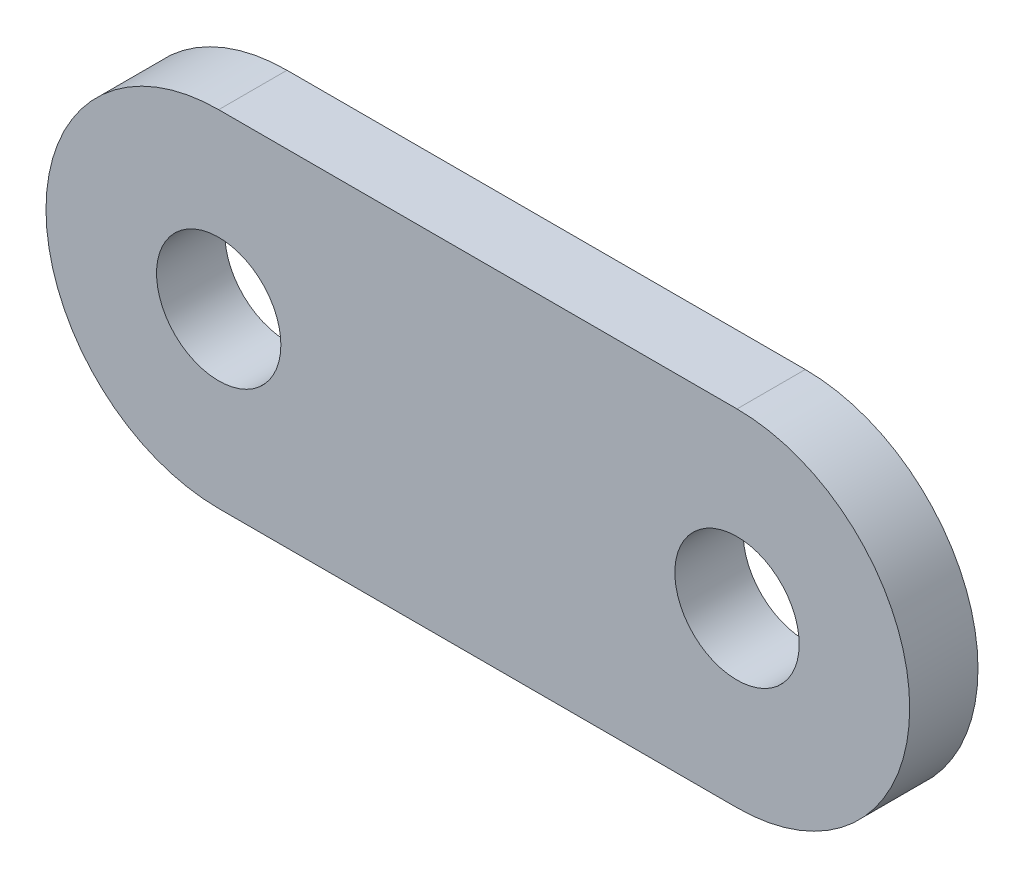
ISO-10303-21;
HEADER;
FILE_DESCRIPTION(('STEP AP214'),'2;1');
FILE_NAME('part.step','',(''),(''),'','','');
FILE_SCHEMA(('AUTOMOTIVE_DESIGN { 1 0 10303 214 1 1 1 1 }'));
ENDSEC;
DATA;
#1=APPLICATION_CONTEXT('core data for automotive mechanical design processes');
#2=APPLICATION_PROTOCOL_DEFINITION('international standard','automotive_design',2000,#1);
#3=PRODUCT_CONTEXT('',#1,'mechanical');
#4=PRODUCT('Part','Part','',(#3));
#5=PRODUCT_RELATED_PRODUCT_CATEGORY('part','',(#4));
#6=PRODUCT_DEFINITION_FORMATION('','',#4);
#7=PRODUCT_DEFINITION_CONTEXT('part definition',#1,'design');
#8=PRODUCT_DEFINITION('design','',#6,#7);
#9=PRODUCT_DEFINITION_SHAPE('','',#8);
#10=(LENGTH_UNIT() NAMED_UNIT(*) SI_UNIT(.MILLI.,.METRE.));
#11=(NAMED_UNIT(*) PLANE_ANGLE_UNIT() SI_UNIT($,.RADIAN.));
#12=(NAMED_UNIT(*) SI_UNIT($,.STERADIAN.) SOLID_ANGLE_UNIT());
#13=UNCERTAINTY_MEASURE_WITH_UNIT(LENGTH_MEASURE(1.E-05),#10,'distance_accuracy_value','');
#14=(GEOMETRIC_REPRESENTATION_CONTEXT(3) GLOBAL_UNCERTAINTY_ASSIGNED_CONTEXT((#13)) GLOBAL_UNIT_ASSIGNED_CONTEXT((#10,
#11,#12)) REPRESENTATION_CONTEXT('',''));
#15=CARTESIAN_POINT('',(0.,0.,0.));
#16=DIRECTION('',(0.,0.,1.));
#17=DIRECTION('',(1.,0.,0.));
#18=AXIS2_PLACEMENT_3D('',#15,#16,#17);
#19=CARTESIAN_POINT('',(0.,0.,4.3942));
#20=DIRECTION('',(0.,0.,1.));
#21=DIRECTION('',(1.,0.,0.));
#22=AXIS2_PLACEMENT_3D('',#19,#20,#21);
#23=PLANE('',#22);
#24=CARTESIAN_POINT('',(0.,0.,4.3942));
#25=DIRECTION('',(0.,0.,1.));
#26=DIRECTION('',(1.,0.,0.));
#27=AXIS2_PLACEMENT_3D('',#24,#25,#26);
#28=CIRCLE('',#27,4.);
#29=CARTESIAN_POINT('',(4.,0.,4.3942));
#30=VERTEX_POINT('',#29);
#31=EDGE_CURVE('E100',#30,#30,#28,.T.);
#32=ORIENTED_EDGE('',*,*,#31,.F.);
#33=EDGE_LOOP('',(#32));
#34=FACE_BOUND('',#33,.T.);
#35=CARTESIAN_POINT('',(0.,0.,4.3942));
#36=DIRECTION('',(0.,0.,1.));
#37=DIRECTION('',(1.,0.,0.));
#38=AXIS2_PLACEMENT_3D('',#35,#36,#37);
#39=CIRCLE('',#38,11.1125);
#40=CARTESIAN_POINT('',(0.,11.1125,4.3942));
#41=VERTEX_POINT('',#40);
#42=CARTESIAN_POINT('',(0.,-11.1125,4.3942));
#43=VERTEX_POINT('',#42);
#44=EDGE_CURVE('E85',#41,#43,#39,.T.);
#45=ORIENTED_EDGE('',*,*,#44,.T.);
#46=DIRECTION('',(1.,0.,0.));
#47=VECTOR('',#46,1.);
#48=CARTESIAN_POINT('',(0.,-11.1125,4.3942));
#49=LINE('',#48,#47);
#50=CARTESIAN_POINT('',(33.3502,-11.1125,4.3942));
#51=VERTEX_POINT('',#50);
#52=EDGE_CURVE('E80',#43,#51,#49,.T.);
#53=ORIENTED_EDGE('',*,*,#52,.T.);
#54=CARTESIAN_POINT('',(33.3502,0.,4.3942));
#55=DIRECTION('',(0.,0.,1.));
#56=DIRECTION('',(1.,0.,0.));
#57=AXIS2_PLACEMENT_3D('',#54,#55,#56);
#58=CIRCLE('',#57,11.1125);
#59=CARTESIAN_POINT('',(33.3502,11.1125,4.3942));
#60=VERTEX_POINT('',#59);
#61=EDGE_CURVE('E83',#51,#60,#58,.T.);
#62=ORIENTED_EDGE('',*,*,#61,.T.);
#63=DIRECTION('',(-1.,0.,0.));
#64=VECTOR('',#63,1.);
#65=CARTESIAN_POINT('',(0.,11.1125,4.3942));
#66=LINE('',#65,#64);
#67=EDGE_CURVE('E50',#60,#41,#66,.T.);
#68=ORIENTED_EDGE('',*,*,#67,.T.);
#69=EDGE_LOOP('',(#45,#53,#62,#68));
#70=FACE_BOUND('',#69,.T.);
#71=CARTESIAN_POINT('',(33.3502,0.,4.3942));
#72=DIRECTION('',(0.,0.,1.));
#73=DIRECTION('',(1.,0.,0.));
#74=AXIS2_PLACEMENT_3D('',#71,#72,#73);
#75=CIRCLE('',#74,4.00000000000001);
#76=CARTESIAN_POINT('',(37.3502,0.,4.3942));
#77=VERTEX_POINT('',#76);
#78=EDGE_CURVE('E115',#77,#77,#75,.T.);
#79=ORIENTED_EDGE('',*,*,#78,.F.);
#80=EDGE_LOOP('',(#79));
#81=FACE_BOUND('',#80,.T.);
#82=ADVANCED_FACE('F33',(#34,#70,#81),#23,.T.);
#83=CARTESIAN_POINT('',(0.,0.,0.));
#84=DIRECTION('',(0.,0.,1.));
#85=DIRECTION('',(1.,0.,0.));
#86=AXIS2_PLACEMENT_3D('',#83,#84,#85);
#87=PLANE('',#86);
#88=CARTESIAN_POINT('',(0.,0.,0.));
#89=DIRECTION('',(0.,0.,1.));
#90=DIRECTION('',(1.,0.,0.));
#91=AXIS2_PLACEMENT_3D('',#88,#89,#90);
#92=CIRCLE('',#91,4.);
#93=CARTESIAN_POINT('',(4.,0.,0.));
#94=VERTEX_POINT('',#93);
#95=EDGE_CURVE('E112',#94,#94,#92,.T.);
#96=ORIENTED_EDGE('',*,*,#95,.T.);
#97=EDGE_LOOP('',(#96));
#98=FACE_BOUND('',#97,.T.);
#99=CARTESIAN_POINT('',(0.,0.,0.));
#100=DIRECTION('',(0.,0.,1.));
#101=DIRECTION('',(1.,0.,0.));
#102=AXIS2_PLACEMENT_3D('',#99,#100,#101);
#103=CIRCLE('',#102,11.1125);
#104=CARTESIAN_POINT('',(0.,11.1125,0.));
#105=VERTEX_POINT('',#104);
#106=CARTESIAN_POINT('',(0.,-11.1125,0.));
#107=VERTEX_POINT('',#106);
#108=EDGE_CURVE('E97',#105,#107,#103,.T.);
#109=ORIENTED_EDGE('',*,*,#108,.F.);
#110=DIRECTION('',(-1.,0.,0.));
#111=VECTOR('',#110,1.);
#112=CARTESIAN_POINT('',(0.,11.1125,0.));
#113=LINE('',#112,#111);
#114=CARTESIAN_POINT('',(33.3502,11.1125,0.));
#115=VERTEX_POINT('',#114);
#116=EDGE_CURVE('E73',#115,#105,#113,.T.);
#117=ORIENTED_EDGE('',*,*,#116,.F.);
#118=CARTESIAN_POINT('',(33.3502,0.,0.));
#119=DIRECTION('',(0.,0.,1.));
#120=DIRECTION('',(1.,0.,0.));
#121=AXIS2_PLACEMENT_3D('',#118,#119,#120);
#122=CIRCLE('',#121,11.1125);
#123=CARTESIAN_POINT('',(33.3502,-11.1125,0.));
#124=VERTEX_POINT('',#123);
#125=EDGE_CURVE('E67',#124,#115,#122,.T.);
#126=ORIENTED_EDGE('',*,*,#125,.F.);
#127=DIRECTION('',(1.,0.,0.));
#128=VECTOR('',#127,1.);
#129=CARTESIAN_POINT('',(0.,-11.1125,0.));
#130=LINE('',#129,#128);
#131=EDGE_CURVE('E89',#107,#124,#130,.T.);
#132=ORIENTED_EDGE('',*,*,#131,.F.);
#133=EDGE_LOOP('',(#109,#117,#126,#132));
#134=FACE_BOUND('',#133,.T.);
#135=CARTESIAN_POINT('',(33.3502,0.,0.));
#136=DIRECTION('',(0.,0.,1.));
#137=DIRECTION('',(1.,0.,0.));
#138=AXIS2_PLACEMENT_3D('',#135,#136,#137);
#139=CIRCLE('',#138,4.00000000000001);
#140=CARTESIAN_POINT('',(37.3502,0.,0.));
#141=VERTEX_POINT('',#140);
#142=EDGE_CURVE('E118',#141,#141,#139,.T.);
#143=ORIENTED_EDGE('',*,*,#142,.T.);
#144=EDGE_LOOP('',(#143));
#145=FACE_BOUND('',#144,.T.);
#146=ADVANCED_FACE('F108',(#98,#134,#145),#87,.F.);
#147=CARTESIAN_POINT('',(0.,0.,4.3942));
#148=DIRECTION('',(0.,0.,-1.));
#149=DIRECTION('',(-1.,0.,0.));
#150=AXIS2_PLACEMENT_3D('',#147,#148,#149);
#151=CYLINDRICAL_SURFACE('',#150,11.1125);
#152=ORIENTED_EDGE('',*,*,#108,.T.);
#153=DIRECTION('',(0.,0.,-1.));
#154=VECTOR('',#153,1.);
#155=CARTESIAN_POINT('',(0.,-11.1125,4.3942));
#156=LINE('',#155,#154);
#157=EDGE_CURVE('E11',#43,#107,#156,.T.);
#158=ORIENTED_EDGE('',*,*,#157,.F.);
#159=ORIENTED_EDGE('',*,*,#44,.F.);
#160=DIRECTION('',(0.,0.,-1.));
#161=VECTOR('',#160,1.);
#162=CARTESIAN_POINT('',(0.,11.1125,4.3942));
#163=LINE('',#162,#161);
#164=EDGE_CURVE('E93',#41,#105,#163,.T.);
#165=ORIENTED_EDGE('',*,*,#164,.T.);
#166=EDGE_LOOP('',(#152,#158,#159,#165));
#167=FACE_BOUND('',#166,.T.);
#168=ADVANCED_FACE('F35',(#167),#151,.T.);
#169=CARTESIAN_POINT('',(0.,-11.1125,4.3942));
#170=DIRECTION('',(0.,1.,0.));
#171=DIRECTION('',(0.,0.,1.));
#172=AXIS2_PLACEMENT_3D('',#169,#170,#171);
#173=PLANE('',#172);
#174=ORIENTED_EDGE('',*,*,#131,.T.);
#175=DIRECTION('',(0.,0.,-1.));
#176=VECTOR('',#175,1.);
#177=CARTESIAN_POINT('',(33.3502,-11.1125,4.3942));
#178=LINE('',#177,#176);
#179=EDGE_CURVE('E42',#51,#124,#178,.T.);
#180=ORIENTED_EDGE('',*,*,#179,.F.);
#181=ORIENTED_EDGE('',*,*,#52,.F.);
#182=ORIENTED_EDGE('',*,*,#157,.T.);
#183=EDGE_LOOP('',(#174,#180,#181,#182));
#184=FACE_BOUND('',#183,.T.);
#185=ADVANCED_FACE('F88',(#184),#173,.F.);
#186=CARTESIAN_POINT('',(33.3502,0.,4.3942));
#187=DIRECTION('',(0.,0.,-1.));
#188=DIRECTION('',(-1.,0.,0.));
#189=AXIS2_PLACEMENT_3D('',#186,#187,#188);
#190=CYLINDRICAL_SURFACE('',#189,11.1125);
#191=ORIENTED_EDGE('',*,*,#125,.T.);
#192=DIRECTION('',(0.,0.,-1.));
#193=VECTOR('',#192,1.);
#194=CARTESIAN_POINT('',(33.3502,11.1125,4.3942));
#195=LINE('',#194,#193);
#196=EDGE_CURVE('E90',#60,#115,#195,.T.);
#197=ORIENTED_EDGE('',*,*,#196,.F.);
#198=ORIENTED_EDGE('',*,*,#61,.F.);
#199=ORIENTED_EDGE('',*,*,#179,.T.);
#200=EDGE_LOOP('',(#191,#197,#198,#199));
#201=FACE_BOUND('',#200,.T.);
#202=ADVANCED_FACE('F91',(#201),#190,.T.);
#203=CARTESIAN_POINT('',(0.,11.1125,4.3942));
#204=DIRECTION('',(0.,-1.,0.));
#205=DIRECTION('',(0.,0.,-1.));
#206=AXIS2_PLACEMENT_3D('',#203,#204,#205);
#207=PLANE('',#206);
#208=ORIENTED_EDGE('',*,*,#116,.T.);
#209=ORIENTED_EDGE('',*,*,#164,.F.);
#210=ORIENTED_EDGE('',*,*,#67,.F.);
#211=ORIENTED_EDGE('',*,*,#196,.T.);
#212=EDGE_LOOP('',(#208,#209,#210,#211));
#213=FACE_BOUND('',#212,.T.);
#214=ADVANCED_FACE('F105',(#213),#207,.F.);
#215=CARTESIAN_POINT('',(0.,0.,4.3942));
#216=DIRECTION('',(0.,0.,-1.));
#217=DIRECTION('',(-1.,0.,0.));
#218=AXIS2_PLACEMENT_3D('',#215,#216,#217);
#219=CYLINDRICAL_SURFACE('',#218,4.);
#220=ORIENTED_EDGE('',*,*,#31,.T.);
#221=EDGE_LOOP('',(#220));
#222=FACE_BOUND('',#221,.T.);
#223=ORIENTED_EDGE('',*,*,#95,.F.);
#224=EDGE_LOOP('',(#223));
#225=FACE_BOUND('',#224,.T.);
#226=ADVANCED_FACE('F136',(#222,#225),#219,.F.);
#227=CARTESIAN_POINT('',(33.3502,0.,4.3942));
#228=DIRECTION('',(0.,0.,-1.));
#229=DIRECTION('',(-1.,0.,0.));
#230=AXIS2_PLACEMENT_3D('',#227,#228,#229);
#231=CYLINDRICAL_SURFACE('',#230,4.00000000000001);
#232=ORIENTED_EDGE('',*,*,#78,.T.);
#233=EDGE_LOOP('',(#232));
#234=FACE_BOUND('',#233,.T.);
#235=ORIENTED_EDGE('',*,*,#142,.F.);
#236=EDGE_LOOP('',(#235));
#237=FACE_BOUND('',#236,.T.);
#238=ADVANCED_FACE('F124',(#234,#237),#231,.F.);
#239=CLOSED_SHELL('',(#82,#146,#168,#185,#202,#214,#226,#238));
#240=MANIFOLD_SOLID_BREP('B2',#239);
#241=ADVANCED_BREP_SHAPE_REPRESENTATION('',(#18,#240),#14);
#242=SHAPE_DEFINITION_REPRESENTATION(#9,#241);
ENDSEC;
END-ISO-10303-21;
